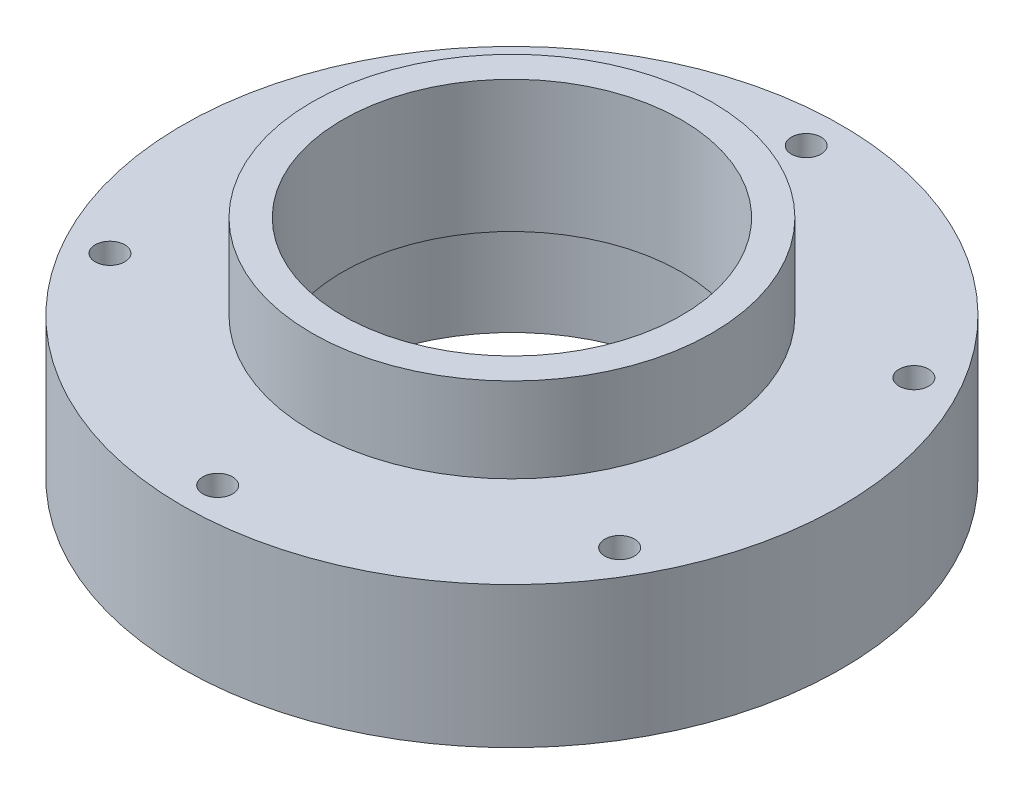
ISO-10303-21;
HEADER;
FILE_DESCRIPTION(('STEP AP214'),'2;1');
FILE_NAME('part.step','',(''),(''),'','','');
FILE_SCHEMA(('AUTOMOTIVE_DESIGN { 1 0 10303 214 1 1 1 1 }'));
ENDSEC;
DATA;
#1=APPLICATION_CONTEXT('core data for automotive mechanical design processes');
#2=APPLICATION_PROTOCOL_DEFINITION('international standard','automotive_design',2000,#1);
#3=PRODUCT_CONTEXT('',#1,'mechanical');
#4=PRODUCT('Part','Part','',(#3));
#5=PRODUCT_RELATED_PRODUCT_CATEGORY('part','',(#4));
#6=PRODUCT_DEFINITION_FORMATION('','',#4);
#7=PRODUCT_DEFINITION_CONTEXT('part definition',#1,'design');
#8=PRODUCT_DEFINITION('design','',#6,#7);
#9=PRODUCT_DEFINITION_SHAPE('','',#8);
#10=(LENGTH_UNIT() NAMED_UNIT(*) SI_UNIT(.MILLI.,.METRE.));
#11=(NAMED_UNIT(*) PLANE_ANGLE_UNIT() SI_UNIT($,.RADIAN.));
#12=(NAMED_UNIT(*) SI_UNIT($,.STERADIAN.) SOLID_ANGLE_UNIT());
#13=UNCERTAINTY_MEASURE_WITH_UNIT(LENGTH_MEASURE(1.E-05),#10,'distance_accuracy_value','');
#14=(GEOMETRIC_REPRESENTATION_CONTEXT(3) GLOBAL_UNCERTAINTY_ASSIGNED_CONTEXT((#13)) GLOBAL_UNIT_ASSIGNED_CONTEXT((#10,
#11,#12)) REPRESENTATION_CONTEXT('',''));
#15=CARTESIAN_POINT('',(0.,0.,0.));
#16=DIRECTION('',(0.,0.,1.));
#17=DIRECTION('',(1.,0.,0.));
#18=AXIS2_PLACEMENT_3D('',#15,#16,#17);
#19=CARTESIAN_POINT('',(0.,7.62,0.));
#20=DIRECTION('',(0.,-1.,0.));
#21=DIRECTION('',(0.,0.,-1.));
#22=AXIS2_PLACEMENT_3D('',#19,#20,#21);
#23=CYLINDRICAL_SURFACE('',#22,17.78);
#24=CARTESIAN_POINT('',(0.,7.62,0.));
#25=DIRECTION('',(0.,1.,0.));
#26=DIRECTION('',(0.,0.,1.));
#27=AXIS2_PLACEMENT_3D('',#24,#25,#26);
#28=CIRCLE('',#27,17.78);
#29=CARTESIAN_POINT('',(0.,7.62,17.78));
#30=VERTEX_POINT('',#29);
#31=EDGE_CURVE('E10',#30,#30,#28,.T.);
#32=ORIENTED_EDGE('',*,*,#31,.F.);
#33=EDGE_LOOP('',(#32));
#34=FACE_BOUND('',#33,.T.);
#35=CARTESIAN_POINT('',(0.,0.,0.));
#36=DIRECTION('',(0.,1.,0.));
#37=DIRECTION('',(0.,0.,1.));
#38=AXIS2_PLACEMENT_3D('',#35,#36,#37);
#39=CIRCLE('',#38,17.78);
#40=CARTESIAN_POINT('',(0.,0.,17.78));
#41=VERTEX_POINT('',#40);
#42=EDGE_CURVE('E42',#41,#41,#39,.T.);
#43=ORIENTED_EDGE('',*,*,#42,.T.);
#44=EDGE_LOOP('',(#43));
#45=FACE_BOUND('',#44,.T.);
#46=ADVANCED_FACE('F39',(#34,#45),#23,.T.);
#47=CARTESIAN_POINT('',(0.,7.62,0.));
#48=DIRECTION('',(0.,1.,0.));
#49=DIRECTION('',(0.,0.,1.));
#50=AXIS2_PLACEMENT_3D('',#47,#48,#49);
#51=PLANE('',#50);
#52=CARTESIAN_POINT('',(0.,7.62,-15.875));
#53=DIRECTION('',(0.,1.,0.));
#54=DIRECTION('',(0.,0.,1.));
#55=AXIS2_PLACEMENT_3D('',#52,#53,#54);
#56=CIRCLE('',#55,0.799999999999993);
#57=CARTESIAN_POINT('',(0.,7.62,-15.075));
#58=VERTEX_POINT('',#57);
#59=EDGE_CURVE('E86',#58,#58,#56,.T.);
#60=ORIENTED_EDGE('',*,*,#59,.F.);
#61=EDGE_LOOP('',(#60));
#62=FACE_BOUND('',#61,.T.);
#63=CARTESIAN_POINT('',(-13.7481532850784,7.62,-7.93750000000078));
#64=DIRECTION('',(0.,1.,0.));
#65=DIRECTION('',(0.,0.,1.));
#66=AXIS2_PLACEMENT_3D('',#63,#64,#65);
#67=CIRCLE('',#66,0.799999999999993);
#68=CARTESIAN_POINT('',(-13.7481532850784,7.62,-7.13750000000079));
#69=VERTEX_POINT('',#68);
#70=EDGE_CURVE('E80',#69,#69,#67,.T.);
#71=ORIENTED_EDGE('',*,*,#70,.F.);
#72=EDGE_LOOP('',(#71));
#73=FACE_BOUND('',#72,.T.);
#74=CARTESIAN_POINT('',(-13.7481532850793,7.62,7.93749999999922));
#75=DIRECTION('',(0.,1.,0.));
#76=DIRECTION('',(0.,0.,1.));
#77=AXIS2_PLACEMENT_3D('',#74,#75,#76);
#78=CIRCLE('',#77,0.799999999999993);
#79=CARTESIAN_POINT('',(-13.7481532850793,7.62,8.73749999999921));
#80=VERTEX_POINT('',#79);
#81=EDGE_CURVE('E74',#80,#80,#78,.T.);
#82=ORIENTED_EDGE('',*,*,#81,.F.);
#83=EDGE_LOOP('',(#82));
#84=FACE_BOUND('',#83,.T.);
#85=CARTESIAN_POINT('',(-1.80089029524336E-12,7.62,15.875));
#86=DIRECTION('',(0.,1.,0.));
#87=DIRECTION('',(0.,0.,1.));
#88=AXIS2_PLACEMENT_3D('',#85,#86,#87);
#89=CIRCLE('',#88,0.799999999999993);
#90=CARTESIAN_POINT('',(-1.80089029524336E-12,7.62,16.675));
#91=VERTEX_POINT('',#90);
#92=EDGE_CURVE('E68',#91,#91,#89,.T.);
#93=ORIENTED_EDGE('',*,*,#92,.F.);
#94=EDGE_LOOP('',(#93));
#95=FACE_BOUND('',#94,.T.);
#96=CARTESIAN_POINT('',(13.7481532850766,7.62,7.93750000000079));
#97=DIRECTION('',(0.,1.,0.));
#98=DIRECTION('',(0.,0.,1.));
#99=AXIS2_PLACEMENT_3D('',#96,#97,#98);
#100=CIRCLE('',#99,0.799999999999993);
#101=CARTESIAN_POINT('',(13.7481532850766,7.62,8.73750000000078));
#102=VERTEX_POINT('',#101);
#103=EDGE_CURVE('E62',#102,#102,#100,.T.);
#104=ORIENTED_EDGE('',*,*,#103,.F.);
#105=EDGE_LOOP('',(#104));
#106=FACE_BOUND('',#105,.T.);
#107=CARTESIAN_POINT('',(13.7481532850775,7.62,-7.93749999999922));
#108=DIRECTION('',(0.,1.,0.));
#109=DIRECTION('',(0.,0.,1.));
#110=AXIS2_PLACEMENT_3D('',#107,#108,#109);
#111=CIRCLE('',#110,0.799999999999993);
#112=CARTESIAN_POINT('',(13.7481532850775,7.62,-7.13749999999923));
#113=VERTEX_POINT('',#112);
#114=EDGE_CURVE('E54',#113,#113,#111,.T.);
#115=ORIENTED_EDGE('',*,*,#114,.F.);
#116=EDGE_LOOP('',(#115));
#117=FACE_BOUND('',#116,.T.);
#118=CARTESIAN_POINT('',(0.,7.62,0.));
#119=DIRECTION('',(0.,1.,0.));
#120=DIRECTION('',(0.,0.,1.));
#121=AXIS2_PLACEMENT_3D('',#118,#119,#120);
#122=CIRCLE('',#121,10.795);
#123=CARTESIAN_POINT('',(0.,7.62,10.795));
#124=VERTEX_POINT('',#123);
#125=EDGE_CURVE('E51',#124,#124,#122,.T.);
#126=ORIENTED_EDGE('',*,*,#125,.F.);
#127=EDGE_LOOP('',(#126));
#128=FACE_BOUND('',#127,.T.);
#129=ORIENTED_EDGE('',*,*,#31,.T.);
#130=EDGE_LOOP('',(#129));
#131=FACE_BOUND('',#130,.T.);
#132=ADVANCED_FACE('F111',(#62,#73,#84,#95,#106,#117,#128,#131),#51,.T.);
#133=CARTESIAN_POINT('',(0.,0.,0.));
#134=DIRECTION('',(0.,1.,0.));
#135=DIRECTION('',(0.,0.,1.));
#136=AXIS2_PLACEMENT_3D('',#133,#134,#135);
#137=PLANE('',#136);
#138=CARTESIAN_POINT('',(0.,0.,0.));
#139=DIRECTION('',(0.,-1.,0.));
#140=DIRECTION('',(0.,0.,-1.));
#141=AXIS2_PLACEMENT_3D('',#138,#139,#140);
#142=CIRCLE('',#141,9.652);
#143=CARTESIAN_POINT('',(0.,0.,-9.652));
#144=VERTEX_POINT('',#143);
#145=EDGE_CURVE('E101',#144,#144,#142,.T.);
#146=ORIENTED_EDGE('',*,*,#145,.F.);
#147=EDGE_LOOP('',(#146));
#148=FACE_BOUND('',#147,.T.);
#149=CARTESIAN_POINT('',(0.,0.,-15.875));
#150=DIRECTION('',(0.,-1.,0.));
#151=DIRECTION('',(0.,0.,-1.));
#152=AXIS2_PLACEMENT_3D('',#149,#150,#151);
#153=CIRCLE('',#152,0.799999999999988);
#154=CARTESIAN_POINT('',(0.,0.,-16.675));
#155=VERTEX_POINT('',#154);
#156=EDGE_CURVE('E89',#155,#155,#153,.T.);
#157=ORIENTED_EDGE('',*,*,#156,.F.);
#158=EDGE_LOOP('',(#157));
#159=FACE_BOUND('',#158,.T.);
#160=CARTESIAN_POINT('',(-13.7481532850784,0.,-7.93750000000078));
#161=DIRECTION('',(0.,-1.,0.));
#162=DIRECTION('',(0.,0.,-1.));
#163=AXIS2_PLACEMENT_3D('',#160,#161,#162);
#164=CIRCLE('',#163,0.799999999999988);
#165=CARTESIAN_POINT('',(-13.7481532850784,0.,-8.73750000000077));
#166=VERTEX_POINT('',#165);
#167=EDGE_CURVE('E83',#166,#166,#164,.T.);
#168=ORIENTED_EDGE('',*,*,#167,.F.);
#169=EDGE_LOOP('',(#168));
#170=FACE_BOUND('',#169,.T.);
#171=CARTESIAN_POINT('',(-13.7481532850793,0.,7.93749999999922));
#172=DIRECTION('',(0.,-1.,0.));
#173=DIRECTION('',(0.,0.,-1.));
#174=AXIS2_PLACEMENT_3D('',#171,#172,#173);
#175=CIRCLE('',#174,0.799999999999988);
#176=CARTESIAN_POINT('',(-13.7481532850793,0.,7.13749999999923));
#177=VERTEX_POINT('',#176);
#178=EDGE_CURVE('E77',#177,#177,#175,.T.);
#179=ORIENTED_EDGE('',*,*,#178,.F.);
#180=EDGE_LOOP('',(#179));
#181=FACE_BOUND('',#180,.T.);
#182=CARTESIAN_POINT('',(-1.80089029524336E-12,0.,15.875));
#183=DIRECTION('',(0.,-1.,0.));
#184=DIRECTION('',(0.,0.,-1.));
#185=AXIS2_PLACEMENT_3D('',#182,#183,#184);
#186=CIRCLE('',#185,0.799999999999988);
#187=CARTESIAN_POINT('',(-1.80089029524336E-12,0.,15.075));
#188=VERTEX_POINT('',#187);
#189=EDGE_CURVE('E71',#188,#188,#186,.T.);
#190=ORIENTED_EDGE('',*,*,#189,.F.);
#191=EDGE_LOOP('',(#190));
#192=FACE_BOUND('',#191,.T.);
#193=CARTESIAN_POINT('',(13.7481532850766,0.,7.93750000000079));
#194=DIRECTION('',(0.,-1.,0.));
#195=DIRECTION('',(0.,0.,-1.));
#196=AXIS2_PLACEMENT_3D('',#193,#194,#195);
#197=CIRCLE('',#196,0.799999999999988);
#198=CARTESIAN_POINT('',(13.7481532850766,0.,7.1375000000008));
#199=VERTEX_POINT('',#198);
#200=EDGE_CURVE('E65',#199,#199,#197,.T.);
#201=ORIENTED_EDGE('',*,*,#200,.F.);
#202=EDGE_LOOP('',(#201));
#203=FACE_BOUND('',#202,.T.);
#204=CARTESIAN_POINT('',(13.7481532850775,0.,-7.93749999999922));
#205=DIRECTION('',(0.,-1.,0.));
#206=DIRECTION('',(0.,0.,-1.));
#207=AXIS2_PLACEMENT_3D('',#204,#205,#206);
#208=CIRCLE('',#207,0.799999999999988);
#209=CARTESIAN_POINT('',(13.7481532850775,0.,-8.73749999999921));
#210=VERTEX_POINT('',#209);
#211=EDGE_CURVE('E59',#210,#210,#208,.T.);
#212=ORIENTED_EDGE('',*,*,#211,.F.);
#213=EDGE_LOOP('',(#212));
#214=FACE_BOUND('',#213,.T.);
#215=ORIENTED_EDGE('',*,*,#42,.F.);
#216=EDGE_LOOP('',(#215));
#217=FACE_BOUND('',#216,.T.);
#218=ADVANCED_FACE('F107',(#148,#159,#170,#181,#192,#203,#214,#217),#137,.F.);
#219=CARTESIAN_POINT('',(0.,12.192,0.));
#220=DIRECTION('',(0.,-1.,0.));
#221=DIRECTION('',(0.,0.,-1.));
#222=AXIS2_PLACEMENT_3D('',#219,#220,#221);
#223=CYLINDRICAL_SURFACE('',#222,10.795);
#224=CARTESIAN_POINT('',(0.,12.192,0.));
#225=DIRECTION('',(0.,1.,0.));
#226=DIRECTION('',(0.,0.,1.));
#227=AXIS2_PLACEMENT_3D('',#224,#225,#226);
#228=CIRCLE('',#227,10.795);
#229=CARTESIAN_POINT('',(0.,12.192,10.795));
#230=VERTEX_POINT('',#229);
#231=EDGE_CURVE('E49',#230,#230,#228,.T.);
#232=ORIENTED_EDGE('',*,*,#231,.F.);
#233=EDGE_LOOP('',(#232));
#234=FACE_BOUND('',#233,.T.);
#235=ORIENTED_EDGE('',*,*,#125,.T.);
#236=EDGE_LOOP('',(#235));
#237=FACE_BOUND('',#236,.T.);
#238=ADVANCED_FACE('F110',(#234,#237),#223,.T.);
#239=CARTESIAN_POINT('',(0.,12.192,0.));
#240=DIRECTION('',(0.,1.,0.));
#241=DIRECTION('',(0.,0.,1.));
#242=AXIS2_PLACEMENT_3D('',#239,#240,#241);
#243=PLANE('',#242);
#244=CARTESIAN_POINT('',(0.,12.192,0.));
#245=DIRECTION('',(0.,-1.,0.));
#246=DIRECTION('',(0.,0.,-1.));
#247=AXIS2_PLACEMENT_3D('',#244,#245,#246);
#248=CIRCLE('',#247,9.144);
#249=CARTESIAN_POINT('',(0.,12.192,-9.144));
#250=VERTEX_POINT('',#249);
#251=EDGE_CURVE('E92',#250,#250,#248,.T.);
#252=ORIENTED_EDGE('',*,*,#251,.T.);
#253=EDGE_LOOP('',(#252));
#254=FACE_BOUND('',#253,.T.);
#255=ORIENTED_EDGE('',*,*,#231,.T.);
#256=EDGE_LOOP('',(#255));
#257=FACE_BOUND('',#256,.T.);
#258=ADVANCED_FACE('F140',(#254,#257),#243,.T.);
#259=CARTESIAN_POINT('',(13.7481532850775,0.,-7.93749999999922));
#260=DIRECTION('',(0.,-1.,0.));
#261=DIRECTION('',(0.,0.,-1.));
#262=AXIS2_PLACEMENT_3D('',#259,#260,#261);
#263=CYLINDRICAL_SURFACE('',#262,0.799999999999993);
#264=ORIENTED_EDGE('',*,*,#114,.T.);
#265=EDGE_LOOP('',(#264));
#266=FACE_BOUND('',#265,.T.);
#267=ORIENTED_EDGE('',*,*,#211,.T.);
#268=EDGE_LOOP('',(#267));
#269=FACE_BOUND('',#268,.T.);
#270=ADVANCED_FACE('F144',(#266,#269),#263,.F.);
#271=CARTESIAN_POINT('',(13.7481532850766,0.,7.93750000000079));
#272=DIRECTION('',(0.,-1.,0.));
#273=DIRECTION('',(0.,0.,-1.));
#274=AXIS2_PLACEMENT_3D('',#271,#272,#273);
#275=CYLINDRICAL_SURFACE('',#274,0.799999999999993);
#276=ORIENTED_EDGE('',*,*,#103,.T.);
#277=EDGE_LOOP('',(#276));
#278=FACE_BOUND('',#277,.T.);
#279=ORIENTED_EDGE('',*,*,#200,.T.);
#280=EDGE_LOOP('',(#279));
#281=FACE_BOUND('',#280,.T.);
#282=ADVANCED_FACE('F148',(#278,#281),#275,.F.);
#283=CARTESIAN_POINT('',(-1.80089029524336E-12,0.,15.875));
#284=DIRECTION('',(0.,-1.,0.));
#285=DIRECTION('',(0.,0.,-1.));
#286=AXIS2_PLACEMENT_3D('',#283,#284,#285);
#287=CYLINDRICAL_SURFACE('',#286,0.799999999999993);
#288=ORIENTED_EDGE('',*,*,#92,.T.);
#289=EDGE_LOOP('',(#288));
#290=FACE_BOUND('',#289,.T.);
#291=ORIENTED_EDGE('',*,*,#189,.T.);
#292=EDGE_LOOP('',(#291));
#293=FACE_BOUND('',#292,.T.);
#294=ADVANCED_FACE('F152',(#290,#293),#287,.F.);
#295=CARTESIAN_POINT('',(-13.7481532850793,0.,7.93749999999922));
#296=DIRECTION('',(0.,-1.,0.));
#297=DIRECTION('',(0.,0.,-1.));
#298=AXIS2_PLACEMENT_3D('',#295,#296,#297);
#299=CYLINDRICAL_SURFACE('',#298,0.799999999999993);
#300=ORIENTED_EDGE('',*,*,#81,.T.);
#301=EDGE_LOOP('',(#300));
#302=FACE_BOUND('',#301,.T.);
#303=ORIENTED_EDGE('',*,*,#178,.T.);
#304=EDGE_LOOP('',(#303));
#305=FACE_BOUND('',#304,.T.);
#306=ADVANCED_FACE('F156',(#302,#305),#299,.F.);
#307=CARTESIAN_POINT('',(-13.7481532850784,0.,-7.93750000000078));
#308=DIRECTION('',(0.,-1.,0.));
#309=DIRECTION('',(0.,0.,-1.));
#310=AXIS2_PLACEMENT_3D('',#307,#308,#309);
#311=CYLINDRICAL_SURFACE('',#310,0.799999999999993);
#312=ORIENTED_EDGE('',*,*,#70,.T.);
#313=EDGE_LOOP('',(#312));
#314=FACE_BOUND('',#313,.T.);
#315=ORIENTED_EDGE('',*,*,#167,.T.);
#316=EDGE_LOOP('',(#315));
#317=FACE_BOUND('',#316,.T.);
#318=ADVANCED_FACE('F160',(#314,#317),#311,.F.);
#319=CARTESIAN_POINT('',(0.,0.,-15.875));
#320=DIRECTION('',(0.,-1.,0.));
#321=DIRECTION('',(0.,0.,-1.));
#322=AXIS2_PLACEMENT_3D('',#319,#320,#321);
#323=CYLINDRICAL_SURFACE('',#322,0.799999999999993);
#324=ORIENTED_EDGE('',*,*,#59,.T.);
#325=EDGE_LOOP('',(#324));
#326=FACE_BOUND('',#325,.T.);
#327=ORIENTED_EDGE('',*,*,#156,.T.);
#328=EDGE_LOOP('',(#327));
#329=FACE_BOUND('',#328,.T.);
#330=ADVANCED_FACE('F164',(#326,#329),#323,.F.);
#331=CARTESIAN_POINT('',(0.,0.,0.));
#332=DIRECTION('',(0.,-1.,0.));
#333=DIRECTION('',(0.,0.,-1.));
#334=AXIS2_PLACEMENT_3D('',#331,#332,#333);
#335=CYLINDRICAL_SURFACE('',#334,9.144);
#336=ORIENTED_EDGE('',*,*,#251,.F.);
#337=EDGE_LOOP('',(#336));
#338=FACE_BOUND('',#337,.T.);
#339=CARTESIAN_POINT('',(0.,5.08,0.));
#340=DIRECTION('',(0.,-1.,0.));
#341=DIRECTION('',(0.,0.,-1.));
#342=AXIS2_PLACEMENT_3D('',#339,#340,#341);
#343=CIRCLE('',#342,9.144);
#344=CARTESIAN_POINT('',(0.,5.08,-9.144));
#345=VERTEX_POINT('',#344);
#346=EDGE_CURVE('E95',#345,#345,#343,.T.);
#347=ORIENTED_EDGE('',*,*,#346,.T.);
#348=EDGE_LOOP('',(#347));
#349=FACE_BOUND('',#348,.T.);
#350=ADVANCED_FACE('F168',(#338,#349),#335,.F.);
#351=CARTESIAN_POINT('',(9.144,5.08,0.));
#352=DIRECTION('',(0.,1.,0.));
#353=DIRECTION('',(0.,0.,1.));
#354=AXIS2_PLACEMENT_3D('',#351,#352,#353);
#355=PLANE('',#354);
#356=ORIENTED_EDGE('',*,*,#346,.F.);
#357=EDGE_LOOP('',(#356));
#358=FACE_BOUND('',#357,.T.);
#359=CARTESIAN_POINT('',(0.,5.08,0.));
#360=DIRECTION('',(0.,-1.,0.));
#361=DIRECTION('',(0.,0.,-1.));
#362=AXIS2_PLACEMENT_3D('',#359,#360,#361);
#363=CIRCLE('',#362,9.652);
#364=CARTESIAN_POINT('',(0.,5.08,-9.652));
#365=VERTEX_POINT('',#364);
#366=EDGE_CURVE('E98',#365,#365,#363,.T.);
#367=ORIENTED_EDGE('',*,*,#366,.T.);
#368=EDGE_LOOP('',(#367));
#369=FACE_BOUND('',#368,.T.);
#370=ADVANCED_FACE('F172',(#358,#369),#355,.F.);
#371=CARTESIAN_POINT('',(0.,0.,0.));
#372=DIRECTION('',(0.,-1.,0.));
#373=DIRECTION('',(0.,0.,-1.));
#374=AXIS2_PLACEMENT_3D('',#371,#372,#373);
#375=CYLINDRICAL_SURFACE('',#374,9.652);
#376=ORIENTED_EDGE('',*,*,#366,.F.);
#377=EDGE_LOOP('',(#376));
#378=FACE_BOUND('',#377,.T.);
#379=ORIENTED_EDGE('',*,*,#145,.T.);
#380=EDGE_LOOP('',(#379));
#381=FACE_BOUND('',#380,.T.);
#382=ADVANCED_FACE('F105',(#378,#381),#375,.F.);
#383=CLOSED_SHELL('',(#46,#132,#218,#238,#258,#270,#282,#294,#306,#318,#330,#350,#370,#382));
#384=MANIFOLD_SOLID_BREP('B2',#383);
#385=ADVANCED_BREP_SHAPE_REPRESENTATION('',(#18,#384),#14);
#386=SHAPE_DEFINITION_REPRESENTATION(#9,#385);
ENDSEC;
END-ISO-10303-21;
